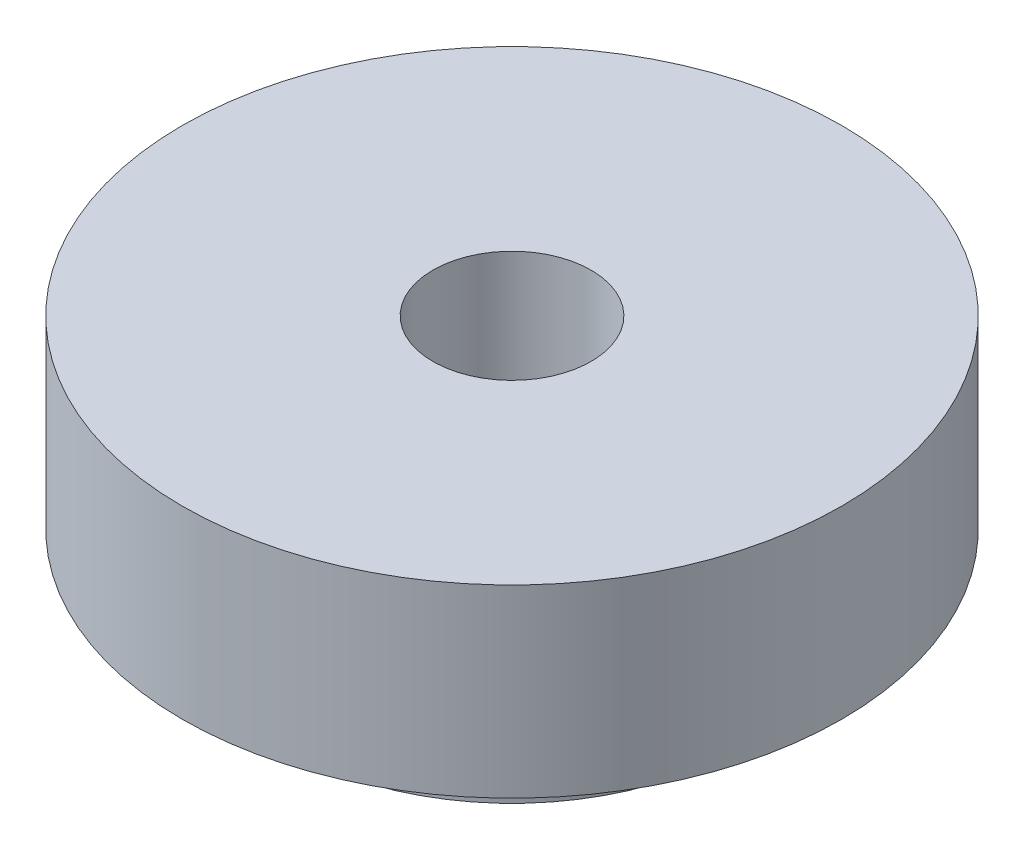
ISO-10303-21;
HEADER;
FILE_DESCRIPTION(('STEP AP214'),'2;1');
FILE_NAME('part.step','',(''),(''),'','','');
FILE_SCHEMA(('AUTOMOTIVE_DESIGN { 1 0 10303 214 1 1 1 1 }'));
ENDSEC;
DATA;
#1=APPLICATION_CONTEXT('core data for automotive mechanical design processes');
#2=APPLICATION_PROTOCOL_DEFINITION('international standard','automotive_design',2000,#1);
#3=PRODUCT_CONTEXT('',#1,'mechanical');
#4=PRODUCT('Part','Part','',(#3));
#5=PRODUCT_RELATED_PRODUCT_CATEGORY('part','',(#4));
#6=PRODUCT_DEFINITION_FORMATION('','',#4);
#7=PRODUCT_DEFINITION_CONTEXT('part definition',#1,'design');
#8=PRODUCT_DEFINITION('design','',#6,#7);
#9=PRODUCT_DEFINITION_SHAPE('','',#8);
#10=(LENGTH_UNIT() NAMED_UNIT(*) SI_UNIT(.MILLI.,.METRE.));
#11=(NAMED_UNIT(*) PLANE_ANGLE_UNIT() SI_UNIT($,.RADIAN.));
#12=(NAMED_UNIT(*) SI_UNIT($,.STERADIAN.) SOLID_ANGLE_UNIT());
#13=UNCERTAINTY_MEASURE_WITH_UNIT(LENGTH_MEASURE(1.E-05),#10,'distance_accuracy_value','');
#14=(GEOMETRIC_REPRESENTATION_CONTEXT(3) GLOBAL_UNCERTAINTY_ASSIGNED_CONTEXT((#13)) GLOBAL_UNIT_ASSIGNED_CONTEXT((#10,
#11,#12)) REPRESENTATION_CONTEXT('',''));
#15=CARTESIAN_POINT('',(0.,0.,0.));
#16=DIRECTION('',(0.,0.,1.));
#17=DIRECTION('',(1.,0.,0.));
#18=AXIS2_PLACEMENT_3D('',#15,#16,#17);
#19=CARTESIAN_POINT('',(0.,50.9343341190336,0.));
#20=DIRECTION('',(0.,1.,0.));
#21=DIRECTION('',(-1.,0.,0.));
#22=AXIS2_PLACEMENT_3D('',#19,#20,#21);
#23=CYLINDRICAL_SURFACE('',#22,2.159);
#24=CARTESIAN_POINT('',(0.,0.,0.));
#25=DIRECTION('',(0.,1.,0.));
#26=DIRECTION('',(-1.,0.,0.));
#27=AXIS2_PLACEMENT_3D('',#24,#25,#26);
#28=CIRCLE('',#27,2.159);
#29=CARTESIAN_POINT('',(-2.15899999999999,0.,0.));
#30=VERTEX_POINT('',#29);
#31=EDGE_CURVE('E55',#30,#30,#28,.T.);
#32=ORIENTED_EDGE('',*,*,#31,.F.);
#33=EDGE_LOOP('',(#32));
#34=FACE_BOUND('',#33,.T.);
#35=CARTESIAN_POINT('',(0.,-0.761999999999999,0.));
#36=DIRECTION('',(0.,1.,0.));
#37=DIRECTION('',(-1.,0.,0.));
#38=AXIS2_PLACEMENT_3D('',#35,#36,#37);
#39=CIRCLE('',#38,2.159);
#40=CARTESIAN_POINT('',(-2.15899999999999,-0.761999999999999,0.));
#41=VERTEX_POINT('',#40);
#42=EDGE_CURVE('E10',#41,#41,#39,.T.);
#43=ORIENTED_EDGE('',*,*,#42,.T.);
#44=EDGE_LOOP('',(#43));
#45=FACE_BOUND('',#44,.T.);
#46=ADVANCED_FACE('F33',(#34,#45),#23,.T.);
#47=CARTESIAN_POINT('',(2.15900000000001,-0.762,0.));
#48=DIRECTION('',(0.,1.,0.));
#49=DIRECTION('',(-1.,0.,0.));
#50=AXIS2_PLACEMENT_3D('',#47,#48,#49);
#51=PLANE('',#50);
#52=ORIENTED_EDGE('',*,*,#42,.F.);
#53=EDGE_LOOP('',(#52));
#54=FACE_BOUND('',#53,.T.);
#55=CARTESIAN_POINT('',(0.,-0.761999999999999,0.));
#56=DIRECTION('',(0.,1.,0.));
#57=DIRECTION('',(-1.,0.,0.));
#58=AXIS2_PLACEMENT_3D('',#55,#56,#57);
#59=CIRCLE('',#58,0.762);
#60=CARTESIAN_POINT('',(-0.761999999999994,-0.761999999999999,0.));
#61=VERTEX_POINT('',#60);
#62=EDGE_CURVE('E39',#61,#61,#59,.T.);
#63=ORIENTED_EDGE('',*,*,#62,.T.);
#64=EDGE_LOOP('',(#63));
#65=FACE_BOUND('',#64,.T.);
#66=ADVANCED_FACE('F62',(#54,#65),#51,.F.);
#67=CARTESIAN_POINT('',(0.,50.9343341190336,0.));
#68=DIRECTION('',(0.,1.,0.));
#69=DIRECTION('',(-1.,0.,0.));
#70=AXIS2_PLACEMENT_3D('',#67,#68,#69);
#71=CYLINDRICAL_SURFACE('',#70,0.762);
#72=ORIENTED_EDGE('',*,*,#62,.F.);
#73=EDGE_LOOP('',(#72));
#74=FACE_BOUND('',#73,.T.);
#75=CARTESIAN_POINT('',(0.,1.778,0.));
#76=DIRECTION('',(0.,1.,0.));
#77=DIRECTION('',(-1.,0.,0.));
#78=AXIS2_PLACEMENT_3D('',#75,#76,#77);
#79=CIRCLE('',#78,0.762000000000001);
#80=CARTESIAN_POINT('',(-0.761999999999995,1.778,0.));
#81=VERTEX_POINT('',#80);
#82=EDGE_CURVE('E43',#81,#81,#79,.T.);
#83=ORIENTED_EDGE('',*,*,#82,.T.);
#84=EDGE_LOOP('',(#83));
#85=FACE_BOUND('',#84,.T.);
#86=ADVANCED_FACE('F66',(#74,#85),#71,.F.);
#87=CARTESIAN_POINT('',(0.762000000000006,1.778,0.));
#88=DIRECTION('',(0.,-1.,0.));
#89=DIRECTION('',(1.,0.,0.));
#90=AXIS2_PLACEMENT_3D('',#87,#88,#89);
#91=PLANE('',#90);
#92=ORIENTED_EDGE('',*,*,#82,.F.);
#93=EDGE_LOOP('',(#92));
#94=FACE_BOUND('',#93,.T.);
#95=CARTESIAN_POINT('',(0.,1.778,0.));
#96=DIRECTION('',(0.,1.,0.));
#97=DIRECTION('',(-1.,0.,0.));
#98=AXIS2_PLACEMENT_3D('',#95,#96,#97);
#99=CIRCLE('',#98,3.175);
#100=CARTESIAN_POINT('',(-3.17499999999999,1.778,0.));
#101=VERTEX_POINT('',#100);
#102=EDGE_CURVE('E47',#101,#101,#99,.T.);
#103=ORIENTED_EDGE('',*,*,#102,.T.);
#104=EDGE_LOOP('',(#103));
#105=FACE_BOUND('',#104,.T.);
#106=ADVANCED_FACE('F71',(#94,#105),#91,.F.);
#107=CARTESIAN_POINT('',(0.,50.9343341190336,0.));
#108=DIRECTION('',(0.,1.,0.));
#109=DIRECTION('',(-1.,0.,0.));
#110=AXIS2_PLACEMENT_3D('',#107,#108,#109);
#111=CYLINDRICAL_SURFACE('',#110,3.175);
#112=ORIENTED_EDGE('',*,*,#102,.F.);
#113=EDGE_LOOP('',(#112));
#114=FACE_BOUND('',#113,.T.);
#115=CARTESIAN_POINT('',(0.,0.,0.));
#116=DIRECTION('',(0.,1.,0.));
#117=DIRECTION('',(-1.,0.,0.));
#118=AXIS2_PLACEMENT_3D('',#115,#116,#117);
#119=CIRCLE('',#118,3.175);
#120=CARTESIAN_POINT('',(-3.17499999999999,0.,0.));
#121=VERTEX_POINT('',#120);
#122=EDGE_CURVE('E52',#121,#121,#119,.T.);
#123=ORIENTED_EDGE('',*,*,#122,.T.);
#124=EDGE_LOOP('',(#123));
#125=FACE_BOUND('',#124,.T.);
#126=ADVANCED_FACE('F77',(#114,#125),#111,.T.);
#127=CARTESIAN_POINT('',(2.159,0.,0.));
#128=DIRECTION('',(0.,1.,0.));
#129=DIRECTION('',(-1.,0.,0.));
#130=AXIS2_PLACEMENT_3D('',#127,#128,#129);
#131=PLANE('',#130);
#132=ORIENTED_EDGE('',*,*,#122,.F.);
#133=EDGE_LOOP('',(#132));
#134=FACE_BOUND('',#133,.T.);
#135=ORIENTED_EDGE('',*,*,#31,.T.);
#136=EDGE_LOOP('',(#135));
#137=FACE_BOUND('',#136,.T.);
#138=ADVANCED_FACE('F59',(#134,#137),#131,.F.);
#139=CLOSED_SHELL('',(#46,#66,#86,#106,#126,#138));
#140=MANIFOLD_SOLID_BREP('B2',#139);
#141=ADVANCED_BREP_SHAPE_REPRESENTATION('',(#18,#140),#14);
#142=SHAPE_DEFINITION_REPRESENTATION(#9,#141);
ENDSEC;
END-ISO-10303-21;
